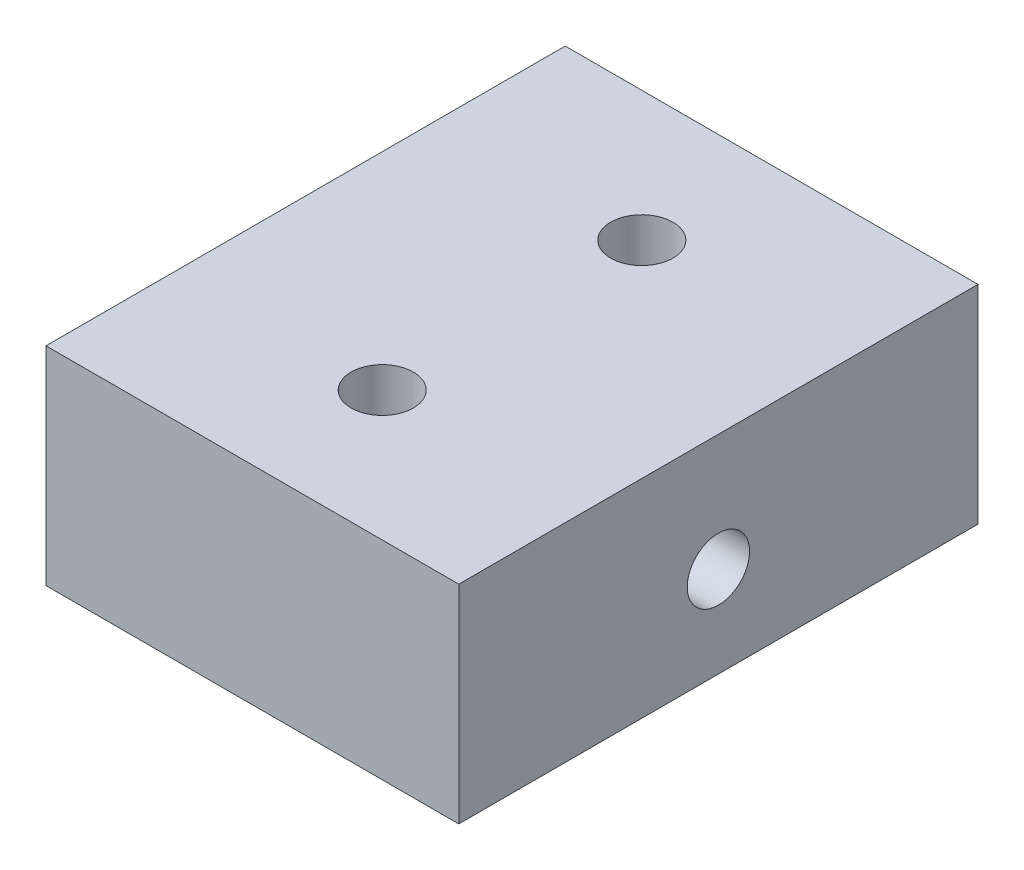
ISO-10303-21;
HEADER;
FILE_DESCRIPTION(('STEP AP214'),'2;1');
FILE_NAME('part.step','',(''),(''),'','','');
FILE_SCHEMA(('AUTOMOTIVE_DESIGN { 1 0 10303 214 1 1 1 1 }'));
ENDSEC;
DATA;
#1=APPLICATION_CONTEXT('core data for automotive mechanical design processes');
#2=APPLICATION_PROTOCOL_DEFINITION('international standard','automotive_design',2000,#1);
#3=PRODUCT_CONTEXT('',#1,'mechanical');
#4=PRODUCT('Part','Part','',(#3));
#5=PRODUCT_RELATED_PRODUCT_CATEGORY('part','',(#4));
#6=PRODUCT_DEFINITION_FORMATION('','',#4);
#7=PRODUCT_DEFINITION_CONTEXT('part definition',#1,'design');
#8=PRODUCT_DEFINITION('design','',#6,#7);
#9=PRODUCT_DEFINITION_SHAPE('','',#8);
#10=(LENGTH_UNIT() NAMED_UNIT(*) SI_UNIT(.MILLI.,.METRE.));
#11=(NAMED_UNIT(*) PLANE_ANGLE_UNIT() SI_UNIT($,.RADIAN.));
#12=(NAMED_UNIT(*) SI_UNIT($,.STERADIAN.) SOLID_ANGLE_UNIT());
#13=UNCERTAINTY_MEASURE_WITH_UNIT(LENGTH_MEASURE(1.E-05),#10,'distance_accuracy_value','');
#14=(GEOMETRIC_REPRESENTATION_CONTEXT(3) GLOBAL_UNCERTAINTY_ASSIGNED_CONTEXT((#13)) GLOBAL_UNIT_ASSIGNED_CONTEXT((#10,
#11,#12)) REPRESENTATION_CONTEXT('',''));
#15=CARTESIAN_POINT('',(0.,0.,0.));
#16=DIRECTION('',(0.,0.,1.));
#17=DIRECTION('',(1.,0.,0.));
#18=AXIS2_PLACEMENT_3D('',#15,#16,#17);
#19=CARTESIAN_POINT('',(0.,0.,20.));
#20=DIRECTION('',(1.,0.,0.));
#21=DIRECTION('',(0.,0.,-1.));
#22=AXIS2_PLACEMENT_3D('',#19,#20,#21);
#23=PLANE('',#22);
#24=CARTESIAN_POINT('',(0.,3.5,10.));
#25=DIRECTION('',(1.,0.,0.));
#26=DIRECTION('',(0.,0.,-1.));
#27=AXIS2_PLACEMENT_3D('',#24,#25,#26);
#28=CIRCLE('',#27,1.2);
#29=CARTESIAN_POINT('',(0.,3.5,8.8));
#30=VERTEX_POINT('',#29);
#31=EDGE_CURVE('E98',#30,#30,#28,.T.);
#32=ORIENTED_EDGE('',*,*,#31,.T.);
#33=EDGE_LOOP('',(#32));
#34=FACE_BOUND('',#33,.T.);
#35=DIRECTION('',(0.,-1.,0.));
#36=VECTOR('',#35,1.);
#37=CARTESIAN_POINT('',(0.,0.,0.));
#38=LINE('',#37,#36);
#39=CARTESIAN_POINT('',(0.,8.,0.));
#40=VERTEX_POINT('',#39);
#41=CARTESIAN_POINT('',(0.,0.,0.));
#42=VERTEX_POINT('',#41);
#43=EDGE_CURVE('E95',#40,#42,#38,.T.);
#44=ORIENTED_EDGE('',*,*,#43,.T.);
#45=DIRECTION('',(0.,0.,-1.));
#46=VECTOR('',#45,1.);
#47=CARTESIAN_POINT('',(0.,0.,20.));
#48=LINE('',#47,#46);
#49=CARTESIAN_POINT('',(0.,0.,20.));
#50=VERTEX_POINT('',#49);
#51=EDGE_CURVE('E11',#50,#42,#48,.T.);
#52=ORIENTED_EDGE('',*,*,#51,.F.);
#53=DIRECTION('',(0.,-1.,0.));
#54=VECTOR('',#53,1.);
#55=CARTESIAN_POINT('',(0.,0.,20.));
#56=LINE('',#55,#54);
#57=CARTESIAN_POINT('',(0.,8.,20.));
#58=VERTEX_POINT('',#57);
#59=EDGE_CURVE('E83',#58,#50,#56,.T.);
#60=ORIENTED_EDGE('',*,*,#59,.F.);
#61=DIRECTION('',(0.,0.,-1.));
#62=VECTOR('',#61,1.);
#63=CARTESIAN_POINT('',(0.,8.,20.));
#64=LINE('',#63,#62);
#65=EDGE_CURVE('E91',#58,#40,#64,.T.);
#66=ORIENTED_EDGE('',*,*,#65,.T.);
#67=EDGE_LOOP('',(#44,#52,#60,#66));
#68=FACE_BOUND('',#67,.T.);
#69=ADVANCED_FACE('F32',(#34,#68),#23,.F.);
#70=CARTESIAN_POINT('',(0.,0.,20.));
#71=DIRECTION('',(0.,1.,0.));
#72=DIRECTION('',(0.,0.,1.));
#73=AXIS2_PLACEMENT_3D('',#70,#71,#72);
#74=PLANE('',#73);
#75=CARTESIAN_POINT('',(7.95,0.,5.));
#76=DIRECTION('',(0.,1.,0.));
#77=DIRECTION('',(0.,0.,-1.));
#78=AXIS2_PLACEMENT_3D('',#75,#76,#77);
#79=CIRCLE('',#78,1.2);
#80=CARTESIAN_POINT('',(7.95,0.,3.8));
#81=VERTEX_POINT('',#80);
#82=EDGE_CURVE('E118',#81,#81,#79,.T.);
#83=ORIENTED_EDGE('',*,*,#82,.T.);
#84=EDGE_LOOP('',(#83));
#85=FACE_BOUND('',#84,.T.);
#86=CARTESIAN_POINT('',(7.95,0.,15.));
#87=DIRECTION('',(0.,1.,0.));
#88=DIRECTION('',(0.,0.,1.));
#89=AXIS2_PLACEMENT_3D('',#86,#87,#88);
#90=CIRCLE('',#89,1.2);
#91=CARTESIAN_POINT('',(7.95,0.,16.2));
#92=VERTEX_POINT('',#91);
#93=EDGE_CURVE('E112',#92,#92,#90,.T.);
#94=ORIENTED_EDGE('',*,*,#93,.T.);
#95=EDGE_LOOP('',(#94));
#96=FACE_BOUND('',#95,.T.);
#97=DIRECTION('',(1.,0.,0.));
#98=VECTOR('',#97,1.);
#99=CARTESIAN_POINT('',(0.,0.,0.));
#100=LINE('',#99,#98);
#101=CARTESIAN_POINT('',(15.9,0.,0.));
#102=VERTEX_POINT('',#101);
#103=EDGE_CURVE('E87',#42,#102,#100,.T.);
#104=ORIENTED_EDGE('',*,*,#103,.T.);
#105=DIRECTION('',(0.,0.,-1.));
#106=VECTOR('',#105,1.);
#107=CARTESIAN_POINT('',(15.9,0.,20.));
#108=LINE('',#107,#106);
#109=CARTESIAN_POINT('',(15.9,0.,20.));
#110=VERTEX_POINT('',#109);
#111=EDGE_CURVE('E40',#110,#102,#108,.T.);
#112=ORIENTED_EDGE('',*,*,#111,.F.);
#113=DIRECTION('',(1.,0.,0.));
#114=VECTOR('',#113,1.);
#115=CARTESIAN_POINT('',(0.,0.,20.));
#116=LINE('',#115,#114);
#117=EDGE_CURVE('E78',#50,#110,#116,.T.);
#118=ORIENTED_EDGE('',*,*,#117,.F.);
#119=ORIENTED_EDGE('',*,*,#51,.T.);
#120=EDGE_LOOP('',(#104,#112,#118,#119));
#121=FACE_BOUND('',#120,.T.);
#122=ADVANCED_FACE('F86',(#85,#96,#121),#74,.F.);
#123=CARTESIAN_POINT('',(15.9,0.,20.));
#124=DIRECTION('',(-1.,0.,0.));
#125=DIRECTION('',(0.,0.,1.));
#126=AXIS2_PLACEMENT_3D('',#123,#124,#125);
#127=PLANE('',#126);
#128=CARTESIAN_POINT('',(15.9,3.5,10.));
#129=DIRECTION('',(1.,0.,0.));
#130=DIRECTION('',(0.,0.,-1.));
#131=AXIS2_PLACEMENT_3D('',#128,#129,#130);
#132=CIRCLE('',#131,1.2);
#133=CARTESIAN_POINT('',(15.9,3.5,8.8));
#134=VERTEX_POINT('',#133);
#135=EDGE_CURVE('E109',#134,#134,#132,.T.);
#136=ORIENTED_EDGE('',*,*,#135,.F.);
#137=EDGE_LOOP('',(#136));
#138=FACE_BOUND('',#137,.T.);
#139=DIRECTION('',(0.,1.,0.));
#140=VECTOR('',#139,1.);
#141=CARTESIAN_POINT('',(15.9,0.,0.));
#142=LINE('',#141,#140);
#143=CARTESIAN_POINT('',(15.9,8.,0.));
#144=VERTEX_POINT('',#143);
#145=EDGE_CURVE('E65',#102,#144,#142,.T.);
#146=ORIENTED_EDGE('',*,*,#145,.T.);
#147=DIRECTION('',(0.,0.,-1.));
#148=VECTOR('',#147,1.);
#149=CARTESIAN_POINT('',(15.9,8.,20.));
#150=LINE('',#149,#148);
#151=CARTESIAN_POINT('',(15.9,8.,20.));
#152=VERTEX_POINT('',#151);
#153=EDGE_CURVE('E88',#152,#144,#150,.T.);
#154=ORIENTED_EDGE('',*,*,#153,.F.);
#155=DIRECTION('',(0.,1.,0.));
#156=VECTOR('',#155,1.);
#157=CARTESIAN_POINT('',(15.9,0.,20.));
#158=LINE('',#157,#156);
#159=EDGE_CURVE('E81',#110,#152,#158,.T.);
#160=ORIENTED_EDGE('',*,*,#159,.F.);
#161=ORIENTED_EDGE('',*,*,#111,.T.);
#162=EDGE_LOOP('',(#146,#154,#160,#161));
#163=FACE_BOUND('',#162,.T.);
#164=ADVANCED_FACE('F89',(#138,#163),#127,.F.);
#165=CARTESIAN_POINT('',(0.,8.,20.));
#166=DIRECTION('',(0.,-1.,0.));
#167=DIRECTION('',(0.,0.,-1.));
#168=AXIS2_PLACEMENT_3D('',#165,#166,#167);
#169=PLANE('',#168);
#170=CARTESIAN_POINT('',(7.95,8.,5.));
#171=DIRECTION('',(0.,1.,0.));
#172=DIRECTION('',(0.,0.,-1.));
#173=AXIS2_PLACEMENT_3D('',#170,#171,#172);
#174=CIRCLE('',#173,1.2);
#175=CARTESIAN_POINT('',(7.95,8.,3.8));
#176=VERTEX_POINT('',#175);
#177=EDGE_CURVE('E121',#176,#176,#174,.T.);
#178=ORIENTED_EDGE('',*,*,#177,.F.);
#179=EDGE_LOOP('',(#178));
#180=FACE_BOUND('',#179,.T.);
#181=CARTESIAN_POINT('',(7.95,8.,15.));
#182=DIRECTION('',(0.,1.,0.));
#183=DIRECTION('',(0.,0.,1.));
#184=AXIS2_PLACEMENT_3D('',#181,#182,#183);
#185=CIRCLE('',#184,1.2);
#186=CARTESIAN_POINT('',(7.95,8.,16.2));
#187=VERTEX_POINT('',#186);
#188=EDGE_CURVE('E115',#187,#187,#185,.T.);
#189=ORIENTED_EDGE('',*,*,#188,.F.);
#190=EDGE_LOOP('',(#189));
#191=FACE_BOUND('',#190,.T.);
#192=DIRECTION('',(-1.,0.,0.));
#193=VECTOR('',#192,1.);
#194=CARTESIAN_POINT('',(0.,8.,0.));
#195=LINE('',#194,#193);
#196=EDGE_CURVE('E71',#144,#40,#195,.T.);
#197=ORIENTED_EDGE('',*,*,#196,.T.);
#198=ORIENTED_EDGE('',*,*,#65,.F.);
#199=DIRECTION('',(-1.,0.,0.));
#200=VECTOR('',#199,1.);
#201=CARTESIAN_POINT('',(0.,8.,20.));
#202=LINE('',#201,#200);
#203=EDGE_CURVE('E48',#152,#58,#202,.T.);
#204=ORIENTED_EDGE('',*,*,#203,.F.);
#205=ORIENTED_EDGE('',*,*,#153,.T.);
#206=EDGE_LOOP('',(#197,#198,#204,#205));
#207=FACE_BOUND('',#206,.T.);
#208=ADVANCED_FACE('F103',(#180,#191,#207),#169,.F.);
#209=CARTESIAN_POINT('',(0.,0.,20.));
#210=DIRECTION('',(0.,0.,-1.));
#211=DIRECTION('',(-1.,0.,0.));
#212=AXIS2_PLACEMENT_3D('',#209,#210,#211);
#213=PLANE('',#212);
#214=ORIENTED_EDGE('',*,*,#59,.T.);
#215=ORIENTED_EDGE('',*,*,#117,.T.);
#216=ORIENTED_EDGE('',*,*,#159,.T.);
#217=ORIENTED_EDGE('',*,*,#203,.T.);
#218=EDGE_LOOP('',(#214,#215,#216,#217));
#219=FACE_BOUND('',#218,.T.);
#220=ADVANCED_FACE('F79',(#219),#213,.F.);
#221=CARTESIAN_POINT('',(0.,0.,0.));
#222=DIRECTION('',(0.,0.,-1.));
#223=DIRECTION('',(-1.,0.,0.));
#224=AXIS2_PLACEMENT_3D('',#221,#222,#223);
#225=PLANE('',#224);
#226=ORIENTED_EDGE('',*,*,#43,.F.);
#227=ORIENTED_EDGE('',*,*,#196,.F.);
#228=ORIENTED_EDGE('',*,*,#145,.F.);
#229=ORIENTED_EDGE('',*,*,#103,.F.);
#230=EDGE_LOOP('',(#226,#227,#228,#229));
#231=FACE_BOUND('',#230,.T.);
#232=ADVANCED_FACE('F106',(#231),#225,.T.);
#233=CARTESIAN_POINT('',(0.,3.5,10.));
#234=DIRECTION('',(1.,0.,0.));
#235=DIRECTION('',(0.,0.,-1.));
#236=AXIS2_PLACEMENT_3D('',#233,#234,#235);
#237=CYLINDRICAL_SURFACE('',#236,1.2);
#238=ORIENTED_EDGE('',*,*,#31,.F.);
#239=EDGE_LOOP('',(#238));
#240=FACE_BOUND('',#239,.T.);
#241=ORIENTED_EDGE('',*,*,#135,.T.);
#242=EDGE_LOOP('',(#241));
#243=FACE_BOUND('',#242,.T.);
#244=ADVANCED_FACE('F142',(#240,#243),#237,.F.);
#245=CARTESIAN_POINT('',(7.95,0.,15.));
#246=DIRECTION('',(0.,1.,0.));
#247=DIRECTION('',(0.,0.,1.));
#248=AXIS2_PLACEMENT_3D('',#245,#246,#247);
#249=CYLINDRICAL_SURFACE('',#248,1.2);
#250=ORIENTED_EDGE('',*,*,#93,.F.);
#251=EDGE_LOOP('',(#250));
#252=FACE_BOUND('',#251,.T.);
#253=ORIENTED_EDGE('',*,*,#188,.T.);
#254=EDGE_LOOP('',(#253));
#255=FACE_BOUND('',#254,.T.);
#256=ADVANCED_FACE('F132',(#252,#255),#249,.F.);
#257=CARTESIAN_POINT('',(7.95,0.,5.));
#258=DIRECTION('',(0.,1.,0.));
#259=DIRECTION('',(0.,0.,1.));
#260=AXIS2_PLACEMENT_3D('',#257,#258,#259);
#261=CYLINDRICAL_SURFACE('',#260,1.2);
#262=ORIENTED_EDGE('',*,*,#82,.F.);
#263=EDGE_LOOP('',(#262));
#264=FACE_BOUND('',#263,.T.);
#265=ORIENTED_EDGE('',*,*,#177,.T.);
#266=EDGE_LOOP('',(#265));
#267=FACE_BOUND('',#266,.T.);
#268=ADVANCED_FACE('F129',(#264,#267),#261,.F.);
#269=CLOSED_SHELL('',(#69,#122,#164,#208,#220,#232,#244,#256,#268));
#270=MANIFOLD_SOLID_BREP('B2',#269);
#271=ADVANCED_BREP_SHAPE_REPRESENTATION('',(#18,#270),#14);
#272=SHAPE_DEFINITION_REPRESENTATION(#9,#271);
ENDSEC;
END-ISO-10303-21;
